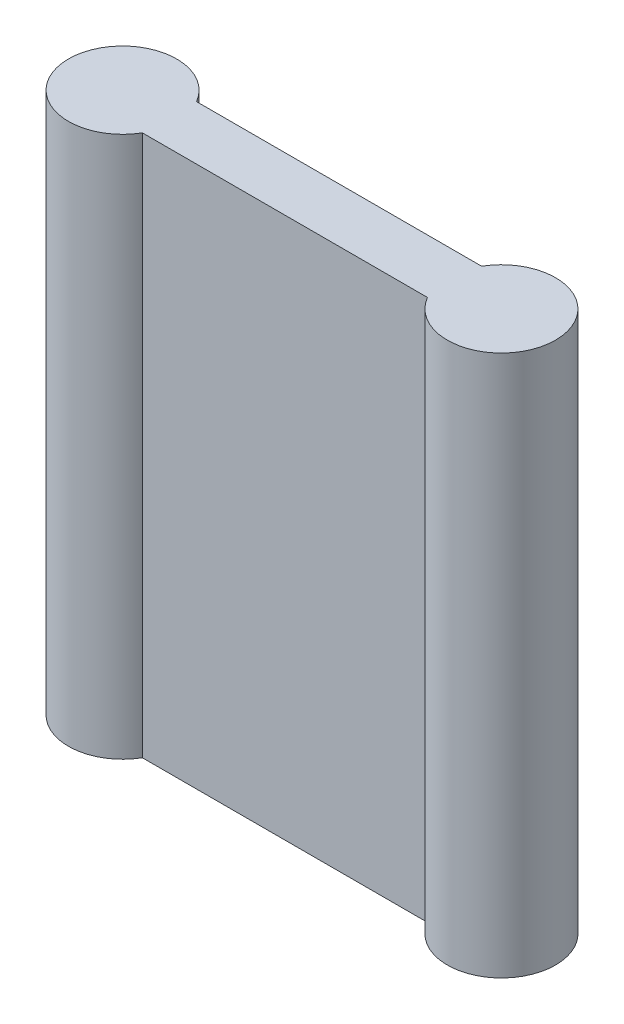
ISO-10303-21;
HEADER;
FILE_DESCRIPTION(('STEP AP214'),'2;1');
FILE_NAME('part.step','',(''),(''),'','','');
FILE_SCHEMA(('AUTOMOTIVE_DESIGN { 1 0 10303 214 1 1 1 1 }'));
ENDSEC;
DATA;
#1=APPLICATION_CONTEXT('core data for automotive mechanical design processes');
#2=APPLICATION_PROTOCOL_DEFINITION('international standard','automotive_design',2000,#1);
#3=PRODUCT_CONTEXT('',#1,'mechanical');
#4=PRODUCT('Part','Part','',(#3));
#5=PRODUCT_RELATED_PRODUCT_CATEGORY('part','',(#4));
#6=PRODUCT_DEFINITION_FORMATION('','',#4);
#7=PRODUCT_DEFINITION_CONTEXT('part definition',#1,'design');
#8=PRODUCT_DEFINITION('design','',#6,#7);
#9=PRODUCT_DEFINITION_SHAPE('','',#8);
#10=(LENGTH_UNIT() NAMED_UNIT(*) SI_UNIT(.MILLI.,.METRE.));
#11=(NAMED_UNIT(*) PLANE_ANGLE_UNIT() SI_UNIT($,.RADIAN.));
#12=(NAMED_UNIT(*) SI_UNIT($,.STERADIAN.) SOLID_ANGLE_UNIT());
#13=UNCERTAINTY_MEASURE_WITH_UNIT(LENGTH_MEASURE(1.E-05),#10,'distance_accuracy_value','');
#14=(GEOMETRIC_REPRESENTATION_CONTEXT(3) GLOBAL_UNCERTAINTY_ASSIGNED_CONTEXT((#13)) GLOBAL_UNIT_ASSIGNED_CONTEXT((#10,
#11,#12)) REPRESENTATION_CONTEXT('',''));
#15=CARTESIAN_POINT('',(0.,0.,0.));
#16=DIRECTION('',(0.,0.,1.));
#17=DIRECTION('',(1.,0.,0.));
#18=AXIS2_PLACEMENT_3D('',#15,#16,#17);
#19=CARTESIAN_POINT('',(7.,-10.,2.));
#20=DIRECTION('',(0.,1.,0.));
#21=DIRECTION('',(0.,0.,1.));
#22=AXIS2_PLACEMENT_3D('',#19,#20,#21);
#23=PLANE('',#22);
#24=DIRECTION('',(1.,0.,0.));
#25=VECTOR('',#24,1.);
#26=CARTESIAN_POINT('',(7.,-10.,0.));
#27=LINE('',#26,#25);
#28=CARTESIAN_POINT('',(-5.26794919243112,-10.,0.));
#29=VERTEX_POINT('',#28);
#30=CARTESIAN_POINT('',(5.26794919243112,-10.,0.));
#31=VERTEX_POINT('',#30);
#32=EDGE_CURVE('E98',#29,#31,#27,.T.);
#33=ORIENTED_EDGE('',*,*,#32,.T.);
#34=CARTESIAN_POINT('',(7.,-10.,1.));
#35=DIRECTION('',(0.,-1.,0.));
#36=DIRECTION('',(1.,0.,0.));
#37=AXIS2_PLACEMENT_3D('',#34,#35,#36);
#38=CIRCLE('',#37,2.);
#39=CARTESIAN_POINT('',(5.26794919243112,-10.,2.));
#40=VERTEX_POINT('',#39);
#41=EDGE_CURVE('E78',#31,#40,#38,.T.);
#42=ORIENTED_EDGE('',*,*,#41,.T.);
#43=DIRECTION('',(1.,0.,0.));
#44=VECTOR('',#43,1.);
#45=CARTESIAN_POINT('',(7.,-10.,2.));
#46=LINE('',#45,#44);
#47=CARTESIAN_POINT('',(-5.26794919243112,-10.,2.));
#48=VERTEX_POINT('',#47);
#49=EDGE_CURVE('E87',#48,#40,#46,.T.);
#50=ORIENTED_EDGE('',*,*,#49,.F.);
#51=CARTESIAN_POINT('',(-7.,-10.,1.));
#52=DIRECTION('',(0.,-1.,0.));
#53=DIRECTION('',(1.,0.,0.));
#54=AXIS2_PLACEMENT_3D('',#51,#52,#53);
#55=CIRCLE('',#54,2.);
#56=EDGE_CURVE('E88',#48,#29,#55,.T.);
#57=ORIENTED_EDGE('',*,*,#56,.T.);
#58=EDGE_LOOP('',(#33,#42,#50,#57));
#59=FACE_BOUND('',#58,.T.);
#60=ADVANCED_FACE('F35',(#59),#23,.F.);
#61=CARTESIAN_POINT('',(7.,10.,2.));
#62=DIRECTION('',(0.,-1.,0.));
#63=DIRECTION('',(1.,0.,0.));
#64=AXIS2_PLACEMENT_3D('',#61,#62,#63);
#65=PLANE('',#64);
#66=DIRECTION('',(-1.,0.,0.));
#67=VECTOR('',#66,1.);
#68=CARTESIAN_POINT('',(7.,10.,2.));
#69=LINE('',#68,#67);
#70=CARTESIAN_POINT('',(5.26794919243112,10.,2.));
#71=VERTEX_POINT('',#70);
#72=CARTESIAN_POINT('',(-5.26794919243113,10.,2.));
#73=VERTEX_POINT('',#72);
#74=EDGE_CURVE('E84',#71,#73,#69,.T.);
#75=ORIENTED_EDGE('',*,*,#74,.F.);
#76=CARTESIAN_POINT('',(7.,10.,1.));
#77=DIRECTION('',(0.,-1.,0.));
#78=DIRECTION('',(1.,0.,0.));
#79=AXIS2_PLACEMENT_3D('',#76,#77,#78);
#80=CIRCLE('',#79,2.);
#81=CARTESIAN_POINT('',(5.26794919243112,10.,0.));
#82=VERTEX_POINT('',#81);
#83=EDGE_CURVE('E49',#71,#82,#80,.F.);
#84=ORIENTED_EDGE('',*,*,#83,.T.);
#85=DIRECTION('',(-1.,0.,0.));
#86=VECTOR('',#85,1.);
#87=CARTESIAN_POINT('',(7.,10.,0.));
#88=LINE('',#87,#86);
#89=CARTESIAN_POINT('',(-5.26794919243113,10.,0.));
#90=VERTEX_POINT('',#89);
#91=EDGE_CURVE('E94',#82,#90,#88,.T.);
#92=ORIENTED_EDGE('',*,*,#91,.T.);
#93=CARTESIAN_POINT('',(-7.,10.,1.));
#94=DIRECTION('',(0.,-1.,0.));
#95=DIRECTION('',(1.,0.,0.));
#96=AXIS2_PLACEMENT_3D('',#93,#94,#95);
#97=CIRCLE('',#96,2.);
#98=EDGE_CURVE('E92',#90,#73,#97,.F.);
#99=ORIENTED_EDGE('',*,*,#98,.T.);
#100=EDGE_LOOP('',(#75,#84,#92,#99));
#101=FACE_BOUND('',#100,.T.);
#102=ADVANCED_FACE('F91',(#101),#65,.F.);
#103=CARTESIAN_POINT('',(0.,0.,2.));
#104=DIRECTION('',(0.,0.,-1.));
#105=DIRECTION('',(-1.,0.,0.));
#106=AXIS2_PLACEMENT_3D('',#103,#104,#105);
#107=PLANE('',#106);
#108=ORIENTED_EDGE('',*,*,#49,.T.);
#109=DIRECTION('',(0.,-1.,0.));
#110=VECTOR('',#109,1.);
#111=CARTESIAN_POINT('',(5.26794919243112,15.6568542494924,2.));
#112=LINE('',#111,#110);
#113=EDGE_CURVE('E74',#40,#71,#112,.F.);
#114=ORIENTED_EDGE('',*,*,#113,.T.);
#115=ORIENTED_EDGE('',*,*,#74,.T.);
#116=DIRECTION('',(0.,-1.,0.));
#117=VECTOR('',#116,1.);
#118=CARTESIAN_POINT('',(-5.26794919243113,15.6568542494924,2.));
#119=LINE('',#118,#117);
#120=EDGE_CURVE('E101',#73,#48,#119,.T.);
#121=ORIENTED_EDGE('',*,*,#120,.T.);
#122=EDGE_LOOP('',(#108,#114,#115,#121));
#123=FACE_BOUND('',#122,.T.);
#124=ADVANCED_FACE('F82',(#123),#107,.F.);
#125=CARTESIAN_POINT('',(0.,0.,0.));
#126=DIRECTION('',(0.,0.,-1.));
#127=DIRECTION('',(-1.,0.,0.));
#128=AXIS2_PLACEMENT_3D('',#125,#126,#127);
#129=PLANE('',#128);
#130=DIRECTION('',(0.,-1.,0.));
#131=VECTOR('',#130,1.);
#132=CARTESIAN_POINT('',(5.26794919243112,15.6568542494924,0.));
#133=LINE('',#132,#131);
#134=EDGE_CURVE('E11',#31,#82,#133,.F.);
#135=ORIENTED_EDGE('',*,*,#134,.F.);
#136=ORIENTED_EDGE('',*,*,#32,.F.);
#137=DIRECTION('',(0.,-1.,0.));
#138=VECTOR('',#137,1.);
#139=CARTESIAN_POINT('',(-5.26794919243113,15.6568542494924,0.));
#140=LINE('',#139,#138);
#141=EDGE_CURVE('E42',#90,#29,#140,.T.);
#142=ORIENTED_EDGE('',*,*,#141,.F.);
#143=ORIENTED_EDGE('',*,*,#91,.F.);
#144=EDGE_LOOP('',(#135,#136,#142,#143));
#145=FACE_BOUND('',#144,.T.);
#146=ADVANCED_FACE('F106',(#145),#129,.T.);
#147=CARTESIAN_POINT('',(-7.00000000000001,15.6568542494924,1.));
#148=DIRECTION('',(0.,-1.,0.));
#149=DIRECTION('',(1.,0.,0.));
#150=AXIS2_PLACEMENT_3D('',#147,#148,#149);
#151=CYLINDRICAL_SURFACE('',#150,2.);
#152=ORIENTED_EDGE('',*,*,#120,.F.);
#153=ORIENTED_EDGE('',*,*,#98,.F.);
#154=ORIENTED_EDGE('',*,*,#141,.T.);
#155=ORIENTED_EDGE('',*,*,#56,.F.);
#156=EDGE_LOOP('',(#152,#153,#154,#155));
#157=FACE_BOUND('',#156,.T.);
#158=ADVANCED_FACE('F103',(#157),#151,.T.);
#159=CARTESIAN_POINT('',(6.99999999999999,15.6568542494924,1.));
#160=DIRECTION('',(0.,-1.,0.));
#161=DIRECTION('',(1.,0.,0.));
#162=AXIS2_PLACEMENT_3D('',#159,#160,#161);
#163=CYLINDRICAL_SURFACE('',#162,2.);
#164=ORIENTED_EDGE('',*,*,#113,.F.);
#165=ORIENTED_EDGE('',*,*,#41,.F.);
#166=ORIENTED_EDGE('',*,*,#134,.T.);
#167=ORIENTED_EDGE('',*,*,#83,.F.);
#168=EDGE_LOOP('',(#164,#165,#166,#167));
#169=FACE_BOUND('',#168,.T.);
#170=ADVANCED_FACE('F73',(#169),#163,.T.);
#171=CLOSED_SHELL('',(#60,#102,#124,#146,#158,#170));
#172=MANIFOLD_SOLID_BREP('B2',#171);
#173=ADVANCED_BREP_SHAPE_REPRESENTATION('',(#18,#172),#14);
#174=SHAPE_DEFINITION_REPRESENTATION(#9,#173);
ENDSEC;
END-ISO-10303-21;
